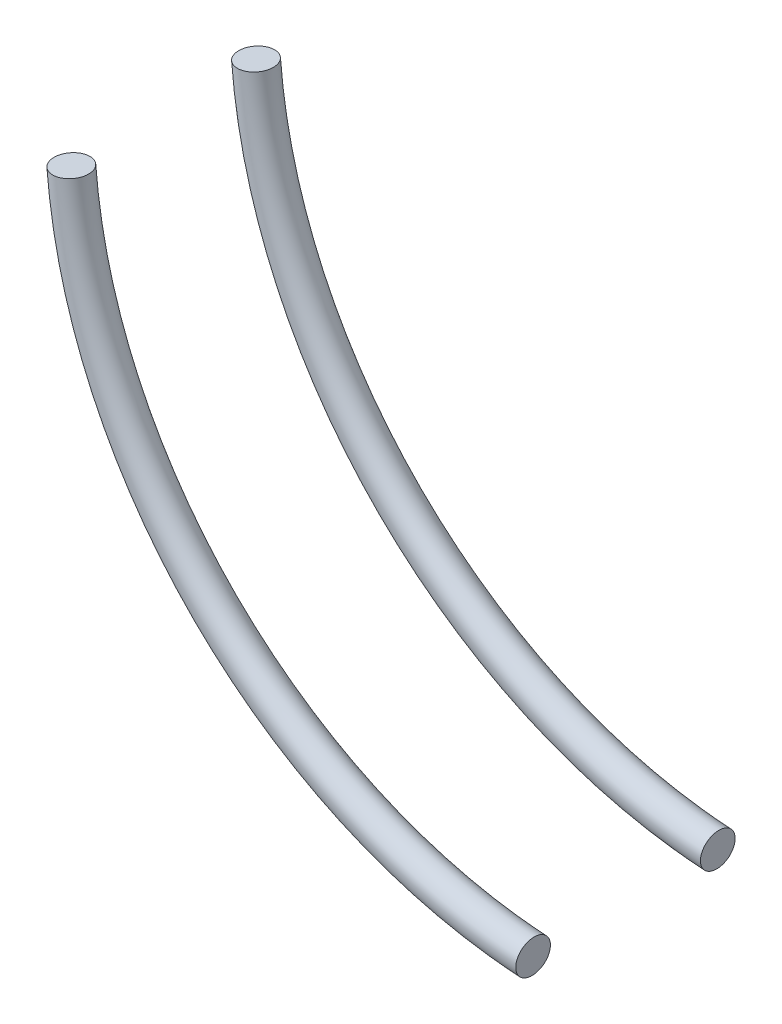
ISO-10303-21;
HEADER;
FILE_DESCRIPTION(('STEP AP214'),'2;1');
FILE_NAME('part.step','',(''),(''),'','','');
FILE_SCHEMA(('AUTOMOTIVE_DESIGN { 1 0 10303 214 1 1 1 1 }'));
ENDSEC;
DATA;
#1=APPLICATION_CONTEXT('core data for automotive mechanical design processes');
#2=APPLICATION_PROTOCOL_DEFINITION('international standard','automotive_design',2000,#1);
#3=PRODUCT_CONTEXT('',#1,'mechanical');
#4=PRODUCT('Part','Part','',(#3));
#5=PRODUCT_RELATED_PRODUCT_CATEGORY('part','',(#4));
#6=PRODUCT_DEFINITION_FORMATION('','',#4);
#7=PRODUCT_DEFINITION_CONTEXT('part definition',#1,'design');
#8=PRODUCT_DEFINITION('design','',#6,#7);
#9=PRODUCT_DEFINITION_SHAPE('','',#8);
#10=(LENGTH_UNIT() NAMED_UNIT(*) SI_UNIT(.MILLI.,.METRE.));
#11=(NAMED_UNIT(*) PLANE_ANGLE_UNIT() SI_UNIT($,.RADIAN.));
#12=(NAMED_UNIT(*) SI_UNIT($,.STERADIAN.) SOLID_ANGLE_UNIT());
#13=UNCERTAINTY_MEASURE_WITH_UNIT(LENGTH_MEASURE(1.E-05),#10,'distance_accuracy_value','');
#14=(GEOMETRIC_REPRESENTATION_CONTEXT(3) GLOBAL_UNCERTAINTY_ASSIGNED_CONTEXT((#13)) GLOBAL_UNIT_ASSIGNED_CONTEXT((#10,
#11,#12)) REPRESENTATION_CONTEXT('',''));
#15=CARTESIAN_POINT('',(0.,0.,0.));
#16=DIRECTION('',(0.,0.,1.));
#17=DIRECTION('',(1.,0.,0.));
#18=AXIS2_PLACEMENT_3D('',#15,#16,#17);
#19=CARTESIAN_POINT('',(0.,20.,4.));
#20=DIRECTION('',(0.0789174124869264,-0.996881157413645,0.));
#21=DIRECTION('',(0.996881157413645,0.0789174124869264,0.));
#22=AXIS2_PLACEMENT_3D('',#19,#20,#21);
#23=PLANE('',#22);
#24=CARTESIAN_POINT('',(0.,20.,4.));
#25=DIRECTION('',(0.0789174124869264,-0.996881157413645,0.));
#26=DIRECTION('',(0.996881157413645,0.0789174124869264,0.));
#27=AXIS2_PLACEMENT_3D('',#24,#25,#26);
#28=CIRCLE('',#27,0.75);
#29=CARTESIAN_POINT('',(0.747660868060233,20.0591880593652,4.));
#30=VERTEX_POINT('',#29);
#31=EDGE_CURVE('E50',#30,#30,#28,.T.);
#32=ORIENTED_EDGE('',*,*,#31,.F.);
#33=EDGE_LOOP('',(#32));
#34=FACE_BOUND('',#33,.T.);
#35=ADVANCED_FACE('F43',(#34),#23,.F.);
#36=CARTESIAN_POINT('',(20.,0.346607862770298,4.));
#37=DIRECTION('',(0.998108356723795,-0.0614793317963437,0.));
#38=DIRECTION('',(0.0614793317963437,0.998108356723795,0.));
#39=AXIS2_PLACEMENT_3D('',#36,#37,#38);
#40=PLANE('',#39);
#41=CARTESIAN_POINT('',(20.,0.346607862770298,4.));
#42=DIRECTION('',(0.998108356723795,-0.0614793317963437,0.));
#43=DIRECTION('',(0.0614793317963437,0.998108356723795,0.));
#44=AXIS2_PLACEMENT_3D('',#41,#42,#43);
#45=CIRCLE('',#44,0.75);
#46=CARTESIAN_POINT('',(20.0461094988473,1.09518913031315,4.));
#47=VERTEX_POINT('',#46);
#48=EDGE_CURVE('E12',#47,#47,#45,.T.);
#49=ORIENTED_EDGE('',*,*,#48,.T.);
#50=EDGE_LOOP('',(#49));
#51=FACE_BOUND('',#50,.T.);
#52=ADVANCED_FACE('F57',(#51),#40,.T.);
#53=CARTESIAN_POINT('',(21.314501000803,21.6873478397339,4.));
#54=DIRECTION('',(0.,0.,1.));
#55=DIRECTION('',(1.,0.,0.));
#56=AXIS2_PLACEMENT_3D('',#53,#54,#55);
#57=TOROIDAL_SURFACE('',#56,21.381185552852,0.75);
#58=ORIENTED_EDGE('',*,*,#48,.F.);
#59=EDGE_LOOP('',(#58));
#60=FACE_BOUND('',#59,.T.);
#61=ORIENTED_EDGE('',*,*,#31,.T.);
#62=EDGE_LOOP('',(#61));
#63=FACE_BOUND('',#62,.T.);
#64=ADVANCED_FACE('F59',(#60,#63),#57,.T.);
#65=CLOSED_SHELL('',(#35,#52,#64));
#66=MANIFOLD_SOLID_BREP('B2',#65);
#67=CARTESIAN_POINT('',(0.,20.,-4.));
#68=DIRECTION('',(0.0789174124869264,-0.996881157413645,0.));
#69=DIRECTION('',(0.996881157413645,0.0789174124869264,0.));
#70=AXIS2_PLACEMENT_3D('',#67,#68,#69);
#71=PLANE('',#70);
#72=CARTESIAN_POINT('',(0.,20.,-4.));
#73=DIRECTION('',(0.0789174124869264,-0.996881157413645,0.));
#74=DIRECTION('',(0.996881157413645,0.0789174124869264,0.));
#75=AXIS2_PLACEMENT_3D('',#72,#73,#74);
#76=CIRCLE('',#75,0.75);
#77=CARTESIAN_POINT('',(0.747660868060235,20.0591880593652,-4.));
#78=VERTEX_POINT('',#77);
#79=EDGE_CURVE('E93',#78,#78,#76,.T.);
#80=ORIENTED_EDGE('',*,*,#79,.F.);
#81=EDGE_LOOP('',(#80));
#82=FACE_BOUND('',#81,.T.);
#83=ADVANCED_FACE('F86',(#82),#71,.F.);
#84=CARTESIAN_POINT('',(20.,0.346607862770301,-4.));
#85=DIRECTION('',(0.998108356723795,-0.0614793317963437,0.));
#86=DIRECTION('',(0.0614793317963437,0.998108356723795,0.));
#87=AXIS2_PLACEMENT_3D('',#84,#85,#86);
#88=PLANE('',#87);
#89=CARTESIAN_POINT('',(20.,0.346607862770301,-4.));
#90=DIRECTION('',(0.998108356723795,-0.0614793317963437,0.));
#91=DIRECTION('',(0.0614793317963437,0.998108356723795,0.));
#92=AXIS2_PLACEMENT_3D('',#89,#90,#91);
#93=CIRCLE('',#92,0.75);
#94=CARTESIAN_POINT('',(20.0461094988473,1.09518913031315,-4.));
#95=VERTEX_POINT('',#94);
#96=EDGE_CURVE('E41',#95,#95,#93,.T.);
#97=ORIENTED_EDGE('',*,*,#96,.T.);
#98=EDGE_LOOP('',(#97));
#99=FACE_BOUND('',#98,.T.);
#100=ADVANCED_FACE('F100',(#99),#88,.T.);
#101=CARTESIAN_POINT('',(21.314501000803,21.6873478397339,-4.));
#102=DIRECTION('',(0.,0.,1.));
#103=DIRECTION('',(1.,0.,0.));
#104=AXIS2_PLACEMENT_3D('',#101,#102,#103);
#105=TOROIDAL_SURFACE('',#104,21.381185552852,0.75);
#106=ORIENTED_EDGE('',*,*,#96,.F.);
#107=EDGE_LOOP('',(#106));
#108=FACE_BOUND('',#107,.T.);
#109=ORIENTED_EDGE('',*,*,#79,.T.);
#110=EDGE_LOOP('',(#109));
#111=FACE_BOUND('',#110,.T.);
#112=ADVANCED_FACE('F102',(#108,#111),#105,.T.);
#113=CLOSED_SHELL('',(#83,#100,#112));
#114=MANIFOLD_SOLID_BREP('B6',#113);
#115=ADVANCED_BREP_SHAPE_REPRESENTATION('',(#18,#66,#114),#14);
#116=SHAPE_DEFINITION_REPRESENTATION(#9,#115);
ENDSEC;
END-ISO-10303-21;
